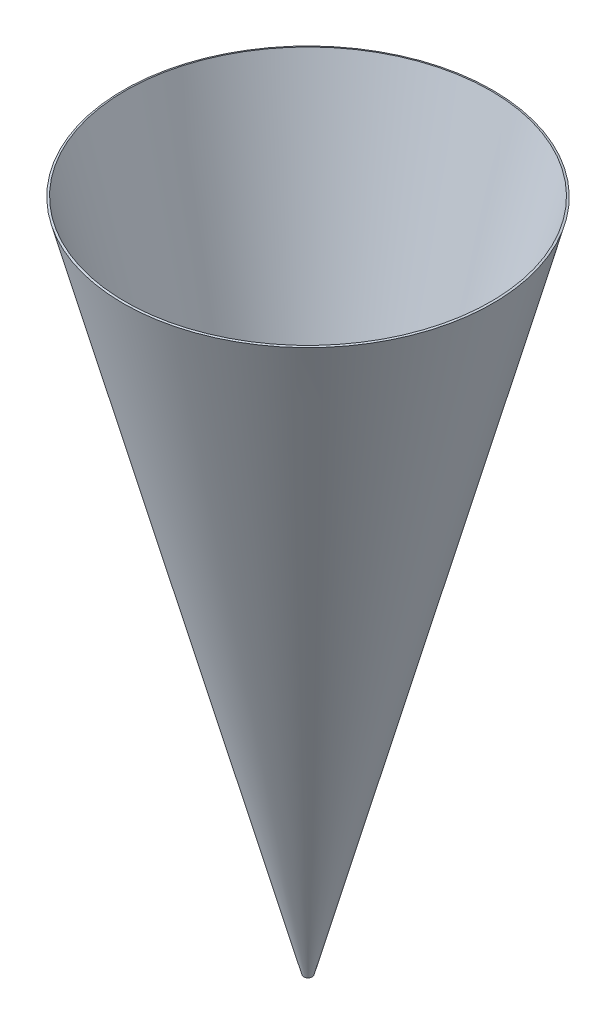
ISO-10303-21;
HEADER;
FILE_DESCRIPTION(('STEP AP214'),'2;1');
FILE_NAME('part.step','',(''),(''),'','','');
FILE_SCHEMA(('AUTOMOTIVE_DESIGN { 1 0 10303 214 1 1 1 1 }'));
ENDSEC;
DATA;
#1=APPLICATION_CONTEXT('core data for automotive mechanical design processes');
#2=APPLICATION_PROTOCOL_DEFINITION('international standard','automotive_design',2000,#1);
#3=PRODUCT_CONTEXT('',#1,'mechanical');
#4=PRODUCT('Part','Part','',(#3));
#5=PRODUCT_RELATED_PRODUCT_CATEGORY('part','',(#4));
#6=PRODUCT_DEFINITION_FORMATION('','',#4);
#7=PRODUCT_DEFINITION_CONTEXT('part definition',#1,'design');
#8=PRODUCT_DEFINITION('design','',#6,#7);
#9=PRODUCT_DEFINITION_SHAPE('','',#8);
#10=(LENGTH_UNIT() NAMED_UNIT(*) SI_UNIT(.MILLI.,.METRE.));
#11=(NAMED_UNIT(*) PLANE_ANGLE_UNIT() SI_UNIT($,.RADIAN.));
#12=(NAMED_UNIT(*) SI_UNIT($,.STERADIAN.) SOLID_ANGLE_UNIT());
#13=UNCERTAINTY_MEASURE_WITH_UNIT(LENGTH_MEASURE(1.E-05),#10,'distance_accuracy_value','');
#14=(GEOMETRIC_REPRESENTATION_CONTEXT(3) GLOBAL_UNCERTAINTY_ASSIGNED_CONTEXT((#13)) GLOBAL_UNIT_ASSIGNED_CONTEXT((#10,
#11,#12)) REPRESENTATION_CONTEXT('',''));
#15=CARTESIAN_POINT('',(0.,0.,0.));
#16=DIRECTION('',(0.,0.,1.));
#17=DIRECTION('',(1.,0.,0.));
#18=AXIS2_PLACEMENT_3D('',#15,#16,#17);
#19=CARTESIAN_POINT('',(0.,0.,0.));
#20=DIRECTION('',(0.,1.,0.));
#21=DIRECTION('',(0.,0.,1.));
#22=AXIS2_PLACEMENT_3D('',#19,#20,#21);
#23=CONICAL_SURFACE('',#22,0.0635,0.26179938779915);
#24=CARTESIAN_POINT('',(0.,10.,0.));
#25=DIRECTION('',(0.,-1.,0.));
#26=DIRECTION('',(0.,0.,-1.));
#27=AXIS2_PLACEMENT_3D('',#24,#25,#26);
#28=CIRCLE('',#27,2.74299192431123);
#29=CARTESIAN_POINT('',(0.,10.,-2.74299192431123));
#30=VERTEX_POINT('',#29);
#31=EDGE_CURVE('E56',#30,#30,#28,.T.);
#32=ORIENTED_EDGE('',*,*,#31,.T.);
#33=EDGE_LOOP('',(#32));
#34=FACE_BOUND('',#33,.T.);
#35=CARTESIAN_POINT('',(0.,0.,0.));
#36=DIRECTION('',(0.,-1.,0.));
#37=DIRECTION('',(0.,0.,-1.));
#38=AXIS2_PLACEMENT_3D('',#35,#36,#37);
#39=CIRCLE('',#38,0.0635);
#40=CARTESIAN_POINT('',(0.,0.,-0.0635));
#41=VERTEX_POINT('',#40);
#42=EDGE_CURVE('E12',#41,#41,#39,.T.);
#43=ORIENTED_EDGE('',*,*,#42,.F.);
#44=EDGE_LOOP('',(#43));
#45=FACE_BOUND('',#44,.T.);
#46=ADVANCED_FACE('F42',(#34,#45),#23,.T.);
#47=CARTESIAN_POINT('',(0.,0.,0.));
#48=DIRECTION('',(0.,-1.,0.));
#49=DIRECTION('',(0.,0.,-1.));
#50=AXIS2_PLACEMENT_3D('',#47,#48,#49);
#51=CONICAL_SURFACE('',#50,0.0635,1.30899693899575);
#52=CARTESIAN_POINT('',(0.,0.00776457135307564,0.));
#53=DIRECTION('',(0.,-1.,0.));
#54=DIRECTION('',(0.,0.,-1.));
#55=AXIS2_PLACEMENT_3D('',#52,#53,#54);
#56=CIRCLE('',#55,0.034522225211328);
#57=CARTESIAN_POINT('',(0.,0.00776457135307564,-0.034522225211328));
#58=VERTEX_POINT('',#57);
#59=EDGE_CURVE('E48',#58,#58,#56,.T.);
#60=ORIENTED_EDGE('',*,*,#59,.F.);
#61=EDGE_LOOP('',(#60));
#62=FACE_BOUND('',#61,.T.);
#63=ORIENTED_EDGE('',*,*,#42,.T.);
#64=EDGE_LOOP('',(#63));
#65=FACE_BOUND('',#64,.T.);
#66=ADVANCED_FACE('F72',(#62,#65),#51,.F.);
#67=CARTESIAN_POINT('',(0.,0.00776457135307564,0.));
#68=DIRECTION('',(0.,1.,0.));
#69=DIRECTION('',(0.,0.,1.));
#70=AXIS2_PLACEMENT_3D('',#67,#68,#69);
#71=CONICAL_SURFACE('',#70,0.034522225211328,0.26179938779915);
#72=CARTESIAN_POINT('',(0.,10.0077645713531,0.));
#73=DIRECTION('',(0.,-1.,0.));
#74=DIRECTION('',(0.,0.,-1.));
#75=AXIS2_PLACEMENT_3D('',#72,#73,#74);
#76=CIRCLE('',#75,2.71401414952256);
#77=CARTESIAN_POINT('',(0.,10.0077645713531,-2.71401414952256));
#78=VERTEX_POINT('',#77);
#79=EDGE_CURVE('E52',#78,#78,#76,.T.);
#80=ORIENTED_EDGE('',*,*,#79,.F.);
#81=EDGE_LOOP('',(#80));
#82=FACE_BOUND('',#81,.T.);
#83=ORIENTED_EDGE('',*,*,#59,.T.);
#84=EDGE_LOOP('',(#83));
#85=FACE_BOUND('',#84,.T.);
#86=ADVANCED_FACE('F67',(#82,#85),#71,.F.);
#87=CARTESIAN_POINT('',(0.,10.0077645713531,0.));
#88=DIRECTION('',(0.,-1.,0.));
#89=DIRECTION('',(0.,0.,-1.));
#90=AXIS2_PLACEMENT_3D('',#87,#88,#89);
#91=CONICAL_SURFACE('',#90,2.71401414952256,1.30899693899561);
#92=ORIENTED_EDGE('',*,*,#31,.F.);
#93=EDGE_LOOP('',(#92));
#94=FACE_BOUND('',#93,.T.);
#95=ORIENTED_EDGE('',*,*,#79,.T.);
#96=EDGE_LOOP('',(#95));
#97=FACE_BOUND('',#96,.T.);
#98=ADVANCED_FACE('F64',(#94,#97),#91,.T.);
#99=CLOSED_SHELL('',(#46,#66,#86,#98));
#100=MANIFOLD_SOLID_BREP('B2',#99);
#101=ADVANCED_BREP_SHAPE_REPRESENTATION('',(#18,#100),#14);
#102=SHAPE_DEFINITION_REPRESENTATION(#9,#101);
ENDSEC;
END-ISO-10303-21;
